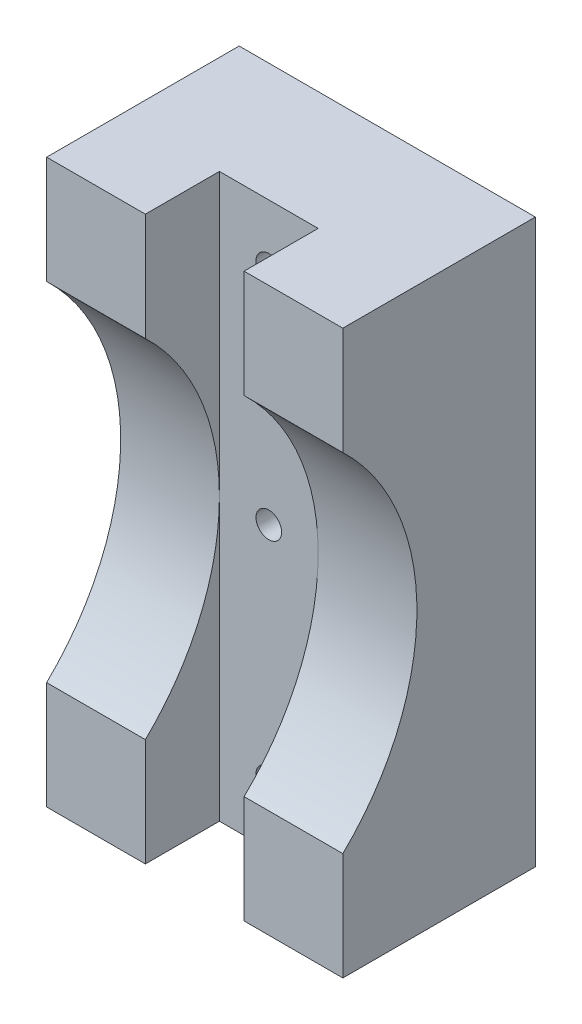
ISO-10303-21;
HEADER;
FILE_DESCRIPTION(('STEP AP214'),'2;1');
FILE_NAME('part.step','',(''),(''),'','','');
FILE_SCHEMA(('AUTOMOTIVE_DESIGN { 1 0 10303 214 1 1 1 1 }'));
ENDSEC;
DATA;
#1=APPLICATION_CONTEXT('core data for automotive mechanical design processes');
#2=APPLICATION_PROTOCOL_DEFINITION('international standard','automotive_design',2000,#1);
#3=PRODUCT_CONTEXT('',#1,'mechanical');
#4=PRODUCT('Part','Part','',(#3));
#5=PRODUCT_RELATED_PRODUCT_CATEGORY('part','',(#4));
#6=PRODUCT_DEFINITION_FORMATION('','',#4);
#7=PRODUCT_DEFINITION_CONTEXT('part definition',#1,'design');
#8=PRODUCT_DEFINITION('design','',#6,#7);
#9=PRODUCT_DEFINITION_SHAPE('','',#8);
#10=(LENGTH_UNIT() NAMED_UNIT(*) SI_UNIT(.MILLI.,.METRE.));
#11=(NAMED_UNIT(*) PLANE_ANGLE_UNIT() SI_UNIT($,.RADIAN.));
#12=(NAMED_UNIT(*) SI_UNIT($,.STERADIAN.) SOLID_ANGLE_UNIT());
#13=UNCERTAINTY_MEASURE_WITH_UNIT(LENGTH_MEASURE(1.E-05),#10,'distance_accuracy_value','');
#14=(GEOMETRIC_REPRESENTATION_CONTEXT(3) GLOBAL_UNCERTAINTY_ASSIGNED_CONTEXT((#13)) GLOBAL_UNIT_ASSIGNED_CONTEXT((#10,
#11,#12)) REPRESENTATION_CONTEXT('',''));
#15=CARTESIAN_POINT('',(0.,0.,0.));
#16=DIRECTION('',(0.,0.,1.));
#17=DIRECTION('',(1.,0.,0.));
#18=AXIS2_PLACEMENT_3D('',#15,#16,#17);
#19=CARTESIAN_POINT('',(0.,0.,0.));
#20=DIRECTION('',(1.,0.,0.));
#21=DIRECTION('',(0.,0.,-1.));
#22=AXIS2_PLACEMENT_3D('',#19,#20,#21);
#23=PLANE('',#22);
#24=DIRECTION('',(0.,1.,0.));
#25=VECTOR('',#24,1.);
#26=CARTESIAN_POINT('',(0.,-28.5,-15.));
#27=LINE('',#26,#25);
#28=CARTESIAN_POINT('',(0.,-28.5,-15.));
#29=VERTEX_POINT('',#28);
#30=CARTESIAN_POINT('',(0.,0.,-15.));
#31=VERTEX_POINT('',#30);
#32=EDGE_CURVE('E47',#29,#31,#27,.T.);
#33=ORIENTED_EDGE('',*,*,#32,.F.);
#34=DIRECTION('',(0.,0.,1.));
#35=VECTOR('',#34,1.);
#36=CARTESIAN_POINT('',(0.,-28.5,0.));
#37=LINE('',#36,#35);
#38=CARTESIAN_POINT('',(0.,-28.5,-7.50000000000001));
#39=VERTEX_POINT('',#38);
#40=EDGE_CURVE('E219',#29,#39,#37,.T.);
#41=ORIENTED_EDGE('',*,*,#40,.T.);
#42=DIRECTION('',(0.,-1.,0.));
#43=VECTOR('',#42,1.);
#44=CARTESIAN_POINT('',(0.,0.,-7.50000000000001));
#45=LINE('',#44,#43);
#46=CARTESIAN_POINT('',(0.,-17.5890590993378,-7.50000000000001));
#47=VERTEX_POINT('',#46);
#48=EDGE_CURVE('E215',#47,#39,#45,.T.);
#49=ORIENTED_EDGE('',*,*,#48,.F.);
#50=CARTESIAN_POINT('',(0.,0.,9.37499999999999));
#51=DIRECTION('',(1.,0.,0.));
#52=DIRECTION('',(0.,0.,-1.));
#53=AXIS2_PLACEMENT_3D('',#50,#51,#52);
#54=CIRCLE('',#53,24.375);
#55=EDGE_CURVE('E214',#31,#47,#54,.F.);
#56=ORIENTED_EDGE('',*,*,#55,.F.);
#57=EDGE_LOOP('',(#33,#41,#49,#56));
#58=FACE_BOUND('',#57,.T.);
#59=ADVANCED_FACE('F36',(#58),#23,.F.);
#60=CARTESIAN_POINT('',(0.,28.5,-15.));
#61=VERTEX_POINT('',#60);
#62=EDGE_CURVE('E12',#31,#61,#27,.T.);
#63=ORIENTED_EDGE('',*,*,#62,.F.);
#64=CARTESIAN_POINT('',(0.,17.5890590993379,-7.50000000000001));
#65=VERTEX_POINT('',#64);
#66=EDGE_CURVE('E216',#65,#31,#54,.F.);
#67=ORIENTED_EDGE('',*,*,#66,.F.);
#68=CARTESIAN_POINT('',(0.,28.5,-7.50000000000001));
#69=VERTEX_POINT('',#68);
#70=EDGE_CURVE('E196',#69,#65,#45,.T.);
#71=ORIENTED_EDGE('',*,*,#70,.F.);
#72=DIRECTION('',(0.,0.,1.));
#73=VECTOR('',#72,1.);
#74=CARTESIAN_POINT('',(0.,28.5,0.));
#75=LINE('',#74,#73);
#76=EDGE_CURVE('E201',#61,#69,#75,.T.);
#77=ORIENTED_EDGE('',*,*,#76,.F.);
#78=EDGE_LOOP('',(#63,#67,#71,#77));
#79=FACE_BOUND('',#78,.T.);
#80=ADVANCED_FACE('F275',(#79),#23,.F.);
#81=CARTESIAN_POINT('',(10.,0.,-7.50000000000001));
#82=DIRECTION('',(0.,0.,-1.));
#83=DIRECTION('',(-1.,0.,0.));
#84=AXIS2_PLACEMENT_3D('',#81,#82,#83);
#85=PLANE('',#84);
#86=ORIENTED_EDGE('',*,*,#70,.T.);
#87=DIRECTION('',(-1.,0.,0.));
#88=VECTOR('',#87,1.);
#89=CARTESIAN_POINT('',(10.,17.5890590993379,-7.50000000000001));
#90=LINE('',#89,#88);
#91=CARTESIAN_POINT('',(10.,17.5890590993379,-7.50000000000001));
#92=VERTEX_POINT('',#91);
#93=EDGE_CURVE('E45',#92,#65,#90,.T.);
#94=ORIENTED_EDGE('',*,*,#93,.F.);
#95=DIRECTION('',(0.,-1.,0.));
#96=VECTOR('',#95,1.);
#97=CARTESIAN_POINT('',(10.,0.,-7.50000000000001));
#98=LINE('',#97,#96);
#99=CARTESIAN_POINT('',(10.,28.5,-7.50000000000001));
#100=VERTEX_POINT('',#99);
#101=EDGE_CURVE('E197',#100,#92,#98,.T.);
#102=ORIENTED_EDGE('',*,*,#101,.F.);
#103=DIRECTION('',(-1.,0.,0.));
#104=VECTOR('',#103,1.);
#105=CARTESIAN_POINT('',(10.,28.5,-7.50000000000001));
#106=LINE('',#105,#104);
#107=EDGE_CURVE('E211',#100,#69,#106,.T.);
#108=ORIENTED_EDGE('',*,*,#107,.T.);
#109=EDGE_LOOP('',(#86,#94,#102,#108));
#110=FACE_BOUND('',#109,.T.);
#111=ADVANCED_FACE('F281',(#110),#85,.F.);
#112=CARTESIAN_POINT('',(10.,0.,9.37499999999999));
#113=DIRECTION('',(-1.,0.,0.));
#114=DIRECTION('',(0.,0.,1.));
#115=AXIS2_PLACEMENT_3D('',#112,#113,#114);
#116=CYLINDRICAL_SURFACE('',#115,24.375);
#117=ORIENTED_EDGE('',*,*,#66,.T.);
#118=ORIENTED_EDGE('',*,*,#55,.T.);
#119=DIRECTION('',(-1.,0.,0.));
#120=VECTOR('',#119,1.);
#121=CARTESIAN_POINT('',(10.,-17.5890590993378,-7.50000000000001));
#122=LINE('',#121,#120);
#123=CARTESIAN_POINT('',(10.,-17.5890590993378,-7.50000000000001));
#124=VERTEX_POINT('',#123);
#125=EDGE_CURVE('E230',#124,#47,#122,.T.);
#126=ORIENTED_EDGE('',*,*,#125,.F.);
#127=CARTESIAN_POINT('',(10.,0.,9.37499999999999));
#128=DIRECTION('',(1.,0.,0.));
#129=DIRECTION('',(0.,0.,-1.));
#130=AXIS2_PLACEMENT_3D('',#127,#128,#129);
#131=CIRCLE('',#130,24.375);
#132=EDGE_CURVE('E200',#92,#124,#131,.F.);
#133=ORIENTED_EDGE('',*,*,#132,.F.);
#134=ORIENTED_EDGE('',*,*,#93,.T.);
#135=EDGE_LOOP('',(#117,#118,#126,#133,#134));
#136=FACE_BOUND('',#135,.T.);
#137=ADVANCED_FACE('F38',(#136),#116,.F.);
#138=ORIENTED_EDGE('',*,*,#48,.T.);
#139=DIRECTION('',(-1.,0.,0.));
#140=VECTOR('',#139,1.);
#141=CARTESIAN_POINT('',(10.,-28.5,-7.50000000000001));
#142=LINE('',#141,#140);
#143=CARTESIAN_POINT('',(10.,-28.5,-7.50000000000001));
#144=VERTEX_POINT('',#143);
#145=EDGE_CURVE('E227',#144,#39,#142,.T.);
#146=ORIENTED_EDGE('',*,*,#145,.F.);
#147=EDGE_CURVE('E202',#124,#144,#98,.T.);
#148=ORIENTED_EDGE('',*,*,#147,.F.);
#149=ORIENTED_EDGE('',*,*,#125,.T.);
#150=EDGE_LOOP('',(#138,#146,#148,#149));
#151=FACE_BOUND('',#150,.T.);
#152=ADVANCED_FACE('F293',(#151),#85,.F.);
#153=CARTESIAN_POINT('',(10.,-28.5,0.));
#154=DIRECTION('',(0.,-1.,0.));
#155=DIRECTION('',(0.,0.,-1.));
#156=AXIS2_PLACEMENT_3D('',#153,#154,#155);
#157=PLANE('',#156);
#158=ORIENTED_EDGE('',*,*,#40,.F.);
#159=DIRECTION('',(1.,0.,0.));
#160=VECTOR('',#159,1.);
#161=CARTESIAN_POINT('',(-10.,-28.5,-15.));
#162=LINE('',#161,#160);
#163=CARTESIAN_POINT('',(-10.,-28.5,-15.));
#164=VERTEX_POINT('',#163);
#165=EDGE_CURVE('E193',#164,#29,#162,.T.);
#166=ORIENTED_EDGE('',*,*,#165,.F.);
#167=DIRECTION('',(0.,0.,1.));
#168=VECTOR('',#167,1.);
#169=CARTESIAN_POINT('',(-10.,-28.5,0.));
#170=LINE('',#169,#168);
#171=CARTESIAN_POINT('',(-10.,-28.5,-7.50000000000001));
#172=VERTEX_POINT('',#171);
#173=EDGE_CURVE('E176',#164,#172,#170,.T.);
#174=ORIENTED_EDGE('',*,*,#173,.T.);
#175=DIRECTION('',(1.,0.,0.));
#176=VECTOR('',#175,1.);
#177=CARTESIAN_POINT('',(-20.,-28.5,-7.50000000000001));
#178=LINE('',#177,#176);
#179=CARTESIAN_POINT('',(-20.,-28.5,-7.50000000000001));
#180=VERTEX_POINT('',#179);
#181=EDGE_CURVE('E144',#180,#172,#178,.T.);
#182=ORIENTED_EDGE('',*,*,#181,.F.);
#183=DIRECTION('',(0.,0.,1.));
#184=VECTOR('',#183,1.);
#185=CARTESIAN_POINT('',(-20.,-28.5,0.));
#186=LINE('',#185,#184);
#187=CARTESIAN_POINT('',(-20.,-28.5,-27.));
#188=VERTEX_POINT('',#187);
#189=EDGE_CURVE('E164',#188,#180,#186,.T.);
#190=ORIENTED_EDGE('',*,*,#189,.F.);
#191=DIRECTION('',(-1.,0.,0.));
#192=VECTOR('',#191,1.);
#193=CARTESIAN_POINT('',(10.,-28.5,-27.));
#194=LINE('',#193,#192);
#195=CARTESIAN_POINT('',(10.,-28.5,-27.));
#196=VERTEX_POINT('',#195);
#197=EDGE_CURVE('E225',#196,#188,#194,.T.);
#198=ORIENTED_EDGE('',*,*,#197,.F.);
#199=DIRECTION('',(0.,0.,1.));
#200=VECTOR('',#199,1.);
#201=CARTESIAN_POINT('',(10.,-28.5,0.));
#202=LINE('',#201,#200);
#203=EDGE_CURVE('E204',#196,#144,#202,.T.);
#204=ORIENTED_EDGE('',*,*,#203,.T.);
#205=ORIENTED_EDGE('',*,*,#145,.T.);
#206=EDGE_LOOP('',(#158,#166,#174,#182,#190,#198,#204,#205));
#207=FACE_BOUND('',#206,.T.);
#208=ADVANCED_FACE('F290',(#207),#157,.T.);
#209=CARTESIAN_POINT('',(10.,0.,-27.));
#210=DIRECTION('',(0.,0.,1.));
#211=DIRECTION('',(1.,0.,0.));
#212=AXIS2_PLACEMENT_3D('',#209,#210,#211);
#213=PLANE('',#212);
#214=CARTESIAN_POINT('',(-5.,22.5,-27.));
#215=DIRECTION('',(0.,0.,1.));
#216=DIRECTION('',(1.,0.,0.));
#217=AXIS2_PLACEMENT_3D('',#214,#215,#216);
#218=CIRCLE('',#217,1.3);
#219=CARTESIAN_POINT('',(-3.7,22.5,-27.));
#220=VERTEX_POINT('',#219);
#221=EDGE_CURVE('E237',#220,#220,#218,.T.);
#222=ORIENTED_EDGE('',*,*,#221,.T.);
#223=EDGE_LOOP('',(#222));
#224=FACE_BOUND('',#223,.T.);
#225=CARTESIAN_POINT('',(-5.,0.,-27.));
#226=DIRECTION('',(0.,0.,1.));
#227=DIRECTION('',(1.,0.,0.));
#228=AXIS2_PLACEMENT_3D('',#225,#226,#227);
#229=CIRCLE('',#228,1.3);
#230=CARTESIAN_POINT('',(-3.7,0.,-27.));
#231=VERTEX_POINT('',#230);
#232=EDGE_CURVE('E240',#231,#231,#229,.T.);
#233=ORIENTED_EDGE('',*,*,#232,.T.);
#234=EDGE_LOOP('',(#233));
#235=FACE_BOUND('',#234,.T.);
#236=CARTESIAN_POINT('',(-5.,-22.5,-27.));
#237=DIRECTION('',(0.,0.,1.));
#238=DIRECTION('',(1.,0.,0.));
#239=AXIS2_PLACEMENT_3D('',#236,#237,#238);
#240=CIRCLE('',#239,1.3);
#241=CARTESIAN_POINT('',(-3.7,-22.5,-27.));
#242=VERTEX_POINT('',#241);
#243=EDGE_CURVE('E173',#242,#242,#240,.T.);
#244=ORIENTED_EDGE('',*,*,#243,.T.);
#245=EDGE_LOOP('',(#244));
#246=FACE_BOUND('',#245,.T.);
#247=ORIENTED_EDGE('',*,*,#197,.T.);
#248=DIRECTION('',(0.,1.,0.));
#249=VECTOR('',#248,1.);
#250=CARTESIAN_POINT('',(-20.,0.,-27.));
#251=LINE('',#250,#249);
#252=CARTESIAN_POINT('',(-20.,28.5,-27.));
#253=VERTEX_POINT('',#252);
#254=EDGE_CURVE('E162',#188,#253,#251,.T.);
#255=ORIENTED_EDGE('',*,*,#254,.T.);
#256=DIRECTION('',(-1.,0.,0.));
#257=VECTOR('',#256,1.);
#258=CARTESIAN_POINT('',(10.,28.5,-27.));
#259=LINE('',#258,#257);
#260=CARTESIAN_POINT('',(10.,28.5,-27.));
#261=VERTEX_POINT('',#260);
#262=EDGE_CURVE('E161',#261,#253,#259,.T.);
#263=ORIENTED_EDGE('',*,*,#262,.F.);
#264=DIRECTION('',(0.,1.,0.));
#265=VECTOR('',#264,1.);
#266=CARTESIAN_POINT('',(10.,0.,-27.));
#267=LINE('',#266,#265);
#268=EDGE_CURVE('E207',#196,#261,#267,.T.);
#269=ORIENTED_EDGE('',*,*,#268,.F.);
#270=EDGE_LOOP('',(#247,#255,#263,#269));
#271=FACE_BOUND('',#270,.T.);
#272=ADVANCED_FACE('F253',(#224,#235,#246,#271),#213,.F.);
#273=CARTESIAN_POINT('',(10.,28.5,0.));
#274=DIRECTION('',(0.,-1.,0.));
#275=DIRECTION('',(0.,0.,-1.));
#276=AXIS2_PLACEMENT_3D('',#273,#274,#275);
#277=PLANE('',#276);
#278=ORIENTED_EDGE('',*,*,#262,.T.);
#279=DIRECTION('',(0.,0.,1.));
#280=VECTOR('',#279,1.);
#281=CARTESIAN_POINT('',(-20.,28.5,0.));
#282=LINE('',#281,#280);
#283=CARTESIAN_POINT('',(-20.,28.5,-7.50000000000001));
#284=VERTEX_POINT('',#283);
#285=EDGE_CURVE('E150',#253,#284,#282,.T.);
#286=ORIENTED_EDGE('',*,*,#285,.T.);
#287=DIRECTION('',(1.,0.,0.));
#288=VECTOR('',#287,1.);
#289=CARTESIAN_POINT('',(-20.,28.5,-7.50000000000001));
#290=LINE('',#289,#288);
#291=CARTESIAN_POINT('',(-10.,28.5,-7.50000000000001));
#292=VERTEX_POINT('',#291);
#293=EDGE_CURVE('E134',#284,#292,#290,.T.);
#294=ORIENTED_EDGE('',*,*,#293,.T.);
#295=DIRECTION('',(0.,0.,1.));
#296=VECTOR('',#295,1.);
#297=CARTESIAN_POINT('',(-10.,28.5,0.));
#298=LINE('',#297,#296);
#299=CARTESIAN_POINT('',(-10.,28.5,-15.));
#300=VERTEX_POINT('',#299);
#301=EDGE_CURVE('E172',#300,#292,#298,.T.);
#302=ORIENTED_EDGE('',*,*,#301,.F.);
#303=DIRECTION('',(1.,0.,0.));
#304=VECTOR('',#303,1.);
#305=CARTESIAN_POINT('',(-10.,28.5,-15.));
#306=LINE('',#305,#304);
#307=EDGE_CURVE('E188',#300,#61,#306,.T.);
#308=ORIENTED_EDGE('',*,*,#307,.T.);
#309=ORIENTED_EDGE('',*,*,#76,.T.);
#310=ORIENTED_EDGE('',*,*,#107,.F.);
#311=DIRECTION('',(0.,0.,1.));
#312=VECTOR('',#311,1.);
#313=CARTESIAN_POINT('',(10.,28.5,0.));
#314=LINE('',#313,#312);
#315=EDGE_CURVE('E209',#261,#100,#314,.T.);
#316=ORIENTED_EDGE('',*,*,#315,.F.);
#317=EDGE_LOOP('',(#278,#286,#294,#302,#308,#309,#310,#316));
#318=FACE_BOUND('',#317,.T.);
#319=ADVANCED_FACE('F158',(#318),#277,.F.);
#320=CARTESIAN_POINT('',(10.,0.,0.));
#321=DIRECTION('',(1.,0.,0.));
#322=DIRECTION('',(0.,0.,-1.));
#323=AXIS2_PLACEMENT_3D('',#320,#321,#322);
#324=PLANE('',#323);
#325=ORIENTED_EDGE('',*,*,#101,.T.);
#326=ORIENTED_EDGE('',*,*,#132,.T.);
#327=ORIENTED_EDGE('',*,*,#147,.T.);
#328=ORIENTED_EDGE('',*,*,#203,.F.);
#329=ORIENTED_EDGE('',*,*,#268,.T.);
#330=ORIENTED_EDGE('',*,*,#315,.T.);
#331=EDGE_LOOP('',(#325,#326,#327,#328,#329,#330));
#332=FACE_BOUND('',#331,.T.);
#333=ADVANCED_FACE('F284',(#332),#324,.T.);
#334=CARTESIAN_POINT('',(-10.,-28.5,-15.));
#335=DIRECTION('',(0.,0.,-1.));
#336=DIRECTION('',(-1.,0.,0.));
#337=AXIS2_PLACEMENT_3D('',#334,#335,#336);
#338=PLANE('',#337);
#339=CARTESIAN_POINT('',(-5.,22.5,-15.));
#340=DIRECTION('',(0.,0.,-1.));
#341=DIRECTION('',(-1.,0.,0.));
#342=AXIS2_PLACEMENT_3D('',#339,#340,#341);
#343=CIRCLE('',#342,1.3);
#344=CARTESIAN_POINT('',(-6.3,22.5,-15.));
#345=VERTEX_POINT('',#344);
#346=EDGE_CURVE('E40',#345,#345,#343,.T.);
#347=ORIENTED_EDGE('',*,*,#346,.T.);
#348=EDGE_LOOP('',(#347));
#349=FACE_BOUND('',#348,.T.);
#350=CARTESIAN_POINT('',(-5.,0.,-15.));
#351=DIRECTION('',(0.,0.,-1.));
#352=DIRECTION('',(-1.,0.,0.));
#353=AXIS2_PLACEMENT_3D('',#350,#351,#352);
#354=CIRCLE('',#353,1.3);
#355=CARTESIAN_POINT('',(-6.3,0.,-15.));
#356=VERTEX_POINT('',#355);
#357=EDGE_CURVE('E238',#356,#356,#354,.T.);
#358=ORIENTED_EDGE('',*,*,#357,.T.);
#359=EDGE_LOOP('',(#358));
#360=FACE_BOUND('',#359,.T.);
#361=CARTESIAN_POINT('',(-5.,-22.5,-15.));
#362=DIRECTION('',(0.,0.,-1.));
#363=DIRECTION('',(-1.,0.,0.));
#364=AXIS2_PLACEMENT_3D('',#361,#362,#363);
#365=CIRCLE('',#364,1.3);
#366=CARTESIAN_POINT('',(-6.3,-22.5,-15.));
#367=VERTEX_POINT('',#366);
#368=EDGE_CURVE('E235',#367,#367,#365,.T.);
#369=ORIENTED_EDGE('',*,*,#368,.T.);
#370=EDGE_LOOP('',(#369));
#371=FACE_BOUND('',#370,.T.);
#372=ORIENTED_EDGE('',*,*,#32,.T.);
#373=ORIENTED_EDGE('',*,*,#62,.T.);
#374=ORIENTED_EDGE('',*,*,#307,.F.);
#375=DIRECTION('',(0.,1.,0.));
#376=VECTOR('',#375,1.);
#377=CARTESIAN_POINT('',(-10.,-28.5,-15.));
#378=LINE('',#377,#376);
#379=CARTESIAN_POINT('',(-10.,0.,-15.));
#380=VERTEX_POINT('',#379);
#381=EDGE_CURVE('E54',#380,#300,#378,.T.);
#382=ORIENTED_EDGE('',*,*,#381,.F.);
#383=EDGE_CURVE('E187',#164,#380,#378,.T.);
#384=ORIENTED_EDGE('',*,*,#383,.F.);
#385=ORIENTED_EDGE('',*,*,#165,.T.);
#386=EDGE_LOOP('',(#372,#373,#374,#382,#384,#385));
#387=FACE_BOUND('',#386,.T.);
#388=ADVANCED_FACE('F315',(#349,#360,#371,#387),#338,.F.);
#389=CARTESIAN_POINT('',(-10.,0.,0.));
#390=DIRECTION('',(-1.,0.,0.));
#391=DIRECTION('',(0.,0.,-1.));
#392=AXIS2_PLACEMENT_3D('',#389,#390,#391);
#393=PLANE('',#392);
#394=ORIENTED_EDGE('',*,*,#173,.F.);
#395=ORIENTED_EDGE('',*,*,#383,.T.);
#396=CARTESIAN_POINT('',(-10.,0.,9.37499999999999));
#397=DIRECTION('',(1.,0.,0.));
#398=DIRECTION('',(0.,0.,-1.));
#399=AXIS2_PLACEMENT_3D('',#396,#397,#398);
#400=CIRCLE('',#399,24.375);
#401=CARTESIAN_POINT('',(-10.,-17.5890590993378,-7.50000000000001));
#402=VERTEX_POINT('',#401);
#403=EDGE_CURVE('E180',#380,#402,#400,.F.);
#404=ORIENTED_EDGE('',*,*,#403,.T.);
#405=DIRECTION('',(0.,-1.,0.));
#406=VECTOR('',#405,1.);
#407=CARTESIAN_POINT('',(-10.,0.,-7.50000000000001));
#408=LINE('',#407,#406);
#409=EDGE_CURVE('E174',#402,#172,#408,.T.);
#410=ORIENTED_EDGE('',*,*,#409,.T.);
#411=EDGE_LOOP('',(#394,#395,#404,#410));
#412=FACE_BOUND('',#411,.T.);
#413=ADVANCED_FACE('F271',(#412),#393,.F.);
#414=CARTESIAN_POINT('',(-20.,0.,-7.50000000000001));
#415=DIRECTION('',(0.,0.,1.));
#416=DIRECTION('',(1.,0.,0.));
#417=AXIS2_PLACEMENT_3D('',#414,#415,#416);
#418=PLANE('',#417);
#419=CARTESIAN_POINT('',(-10.,17.5890590993379,-7.50000000000001));
#420=VERTEX_POINT('',#419);
#421=EDGE_CURVE('E140',#292,#420,#408,.T.);
#422=ORIENTED_EDGE('',*,*,#421,.F.);
#423=ORIENTED_EDGE('',*,*,#293,.F.);
#424=DIRECTION('',(0.,-1.,0.));
#425=VECTOR('',#424,1.);
#426=CARTESIAN_POINT('',(-20.,0.,-7.50000000000001));
#427=LINE('',#426,#425);
#428=CARTESIAN_POINT('',(-20.,17.5890590993379,-7.50000000000001));
#429=VERTEX_POINT('',#428);
#430=EDGE_CURVE('E137',#284,#429,#427,.T.);
#431=ORIENTED_EDGE('',*,*,#430,.T.);
#432=DIRECTION('',(1.,0.,0.));
#433=VECTOR('',#432,1.);
#434=CARTESIAN_POINT('',(-20.,17.5890590993379,-7.50000000000001));
#435=LINE('',#434,#433);
#436=EDGE_CURVE('E170',#429,#420,#435,.T.);
#437=ORIENTED_EDGE('',*,*,#436,.T.);
#438=EDGE_LOOP('',(#422,#423,#431,#437));
#439=FACE_BOUND('',#438,.T.);
#440=ADVANCED_FACE('F136',(#439),#418,.T.);
#441=ORIENTED_EDGE('',*,*,#409,.F.);
#442=DIRECTION('',(1.,0.,0.));
#443=VECTOR('',#442,1.);
#444=CARTESIAN_POINT('',(-20.,-17.5890590993378,-7.50000000000001));
#445=LINE('',#444,#443);
#446=CARTESIAN_POINT('',(-20.,-17.5890590993378,-7.50000000000001));
#447=VERTEX_POINT('',#446);
#448=EDGE_CURVE('E182',#447,#402,#445,.T.);
#449=ORIENTED_EDGE('',*,*,#448,.F.);
#450=EDGE_CURVE('E157',#447,#180,#427,.T.);
#451=ORIENTED_EDGE('',*,*,#450,.T.);
#452=ORIENTED_EDGE('',*,*,#181,.T.);
#453=EDGE_LOOP('',(#441,#449,#451,#452));
#454=FACE_BOUND('',#453,.T.);
#455=ADVANCED_FACE('F325',(#454),#418,.T.);
#456=CARTESIAN_POINT('',(-20.,0.,9.37499999999999));
#457=DIRECTION('',(1.,0.,0.));
#458=DIRECTION('',(0.,0.,-1.));
#459=AXIS2_PLACEMENT_3D('',#456,#457,#458);
#460=CYLINDRICAL_SURFACE('',#459,24.375);
#461=EDGE_CURVE('E155',#420,#380,#400,.F.);
#462=ORIENTED_EDGE('',*,*,#461,.F.);
#463=ORIENTED_EDGE('',*,*,#436,.F.);
#464=CARTESIAN_POINT('',(-20.,0.,9.37499999999999));
#465=DIRECTION('',(1.,0.,0.));
#466=DIRECTION('',(0.,0.,-1.));
#467=AXIS2_PLACEMENT_3D('',#464,#465,#466);
#468=CIRCLE('',#467,24.375);
#469=EDGE_CURVE('E154',#429,#447,#468,.F.);
#470=ORIENTED_EDGE('',*,*,#469,.T.);
#471=ORIENTED_EDGE('',*,*,#448,.T.);
#472=ORIENTED_EDGE('',*,*,#403,.F.);
#473=EDGE_LOOP('',(#462,#463,#470,#471,#472));
#474=FACE_BOUND('',#473,.T.);
#475=ADVANCED_FACE('F319',(#474),#460,.F.);
#476=CARTESIAN_POINT('',(-20.,0.,0.));
#477=DIRECTION('',(-1.,0.,0.));
#478=DIRECTION('',(0.,0.,-1.));
#479=AXIS2_PLACEMENT_3D('',#476,#477,#478);
#480=PLANE('',#479);
#481=ORIENTED_EDGE('',*,*,#430,.F.);
#482=ORIENTED_EDGE('',*,*,#285,.F.);
#483=ORIENTED_EDGE('',*,*,#254,.F.);
#484=ORIENTED_EDGE('',*,*,#189,.T.);
#485=ORIENTED_EDGE('',*,*,#450,.F.);
#486=ORIENTED_EDGE('',*,*,#469,.F.);
#487=EDGE_LOOP('',(#481,#482,#483,#484,#485,#486));
#488=FACE_BOUND('',#487,.T.);
#489=ADVANCED_FACE('F148',(#488),#480,.T.);
#490=ORIENTED_EDGE('',*,*,#461,.T.);
#491=ORIENTED_EDGE('',*,*,#381,.T.);
#492=ORIENTED_EDGE('',*,*,#301,.T.);
#493=ORIENTED_EDGE('',*,*,#421,.T.);
#494=EDGE_LOOP('',(#490,#491,#492,#493));
#495=FACE_BOUND('',#494,.T.);
#496=ADVANCED_FACE('F259',(#495),#393,.F.);
#497=CARTESIAN_POINT('',(-5.,-22.5,-7.50000000000001));
#498=DIRECTION('',(0.,0.,-1.));
#499=DIRECTION('',(-1.,0.,0.));
#500=AXIS2_PLACEMENT_3D('',#497,#498,#499);
#501=CYLINDRICAL_SURFACE('',#500,1.3);
#502=ORIENTED_EDGE('',*,*,#368,.F.);
#503=EDGE_LOOP('',(#502));
#504=FACE_BOUND('',#503,.T.);
#505=ORIENTED_EDGE('',*,*,#243,.F.);
#506=EDGE_LOOP('',(#505));
#507=FACE_BOUND('',#506,.T.);
#508=ADVANCED_FACE('F256',(#504,#507),#501,.F.);
#509=CARTESIAN_POINT('',(-5.,0.,-7.50000000000001));
#510=DIRECTION('',(0.,0.,-1.));
#511=DIRECTION('',(-1.,0.,0.));
#512=AXIS2_PLACEMENT_3D('',#509,#510,#511);
#513=CYLINDRICAL_SURFACE('',#512,1.3);
#514=ORIENTED_EDGE('',*,*,#357,.F.);
#515=EDGE_LOOP('',(#514));
#516=FACE_BOUND('',#515,.T.);
#517=ORIENTED_EDGE('',*,*,#232,.F.);
#518=EDGE_LOOP('',(#517));
#519=FACE_BOUND('',#518,.T.);
#520=ADVANCED_FACE('F258',(#516,#519),#513,.F.);
#521=CARTESIAN_POINT('',(-5.,22.5,-7.50000000000001));
#522=DIRECTION('',(0.,0.,-1.));
#523=DIRECTION('',(-1.,0.,0.));
#524=AXIS2_PLACEMENT_3D('',#521,#522,#523);
#525=CYLINDRICAL_SURFACE('',#524,1.3);
#526=ORIENTED_EDGE('',*,*,#346,.F.);
#527=EDGE_LOOP('',(#526));
#528=FACE_BOUND('',#527,.T.);
#529=ORIENTED_EDGE('',*,*,#221,.F.);
#530=EDGE_LOOP('',(#529));
#531=FACE_BOUND('',#530,.T.);
#532=ADVANCED_FACE('F266',(#528,#531),#525,.F.);
#533=CLOSED_SHELL('',(#59,#80,#111,#137,#152,#208,#272,#319,#333,#388,#413,#440,#455,#475,#489,
#496,#508,#520,#532));
#534=MANIFOLD_SOLID_BREP('B2',#533);
#535=ADVANCED_BREP_SHAPE_REPRESENTATION('',(#18,#534),#14);
#536=SHAPE_DEFINITION_REPRESENTATION(#9,#535);
ENDSEC;
END-ISO-10303-21;
